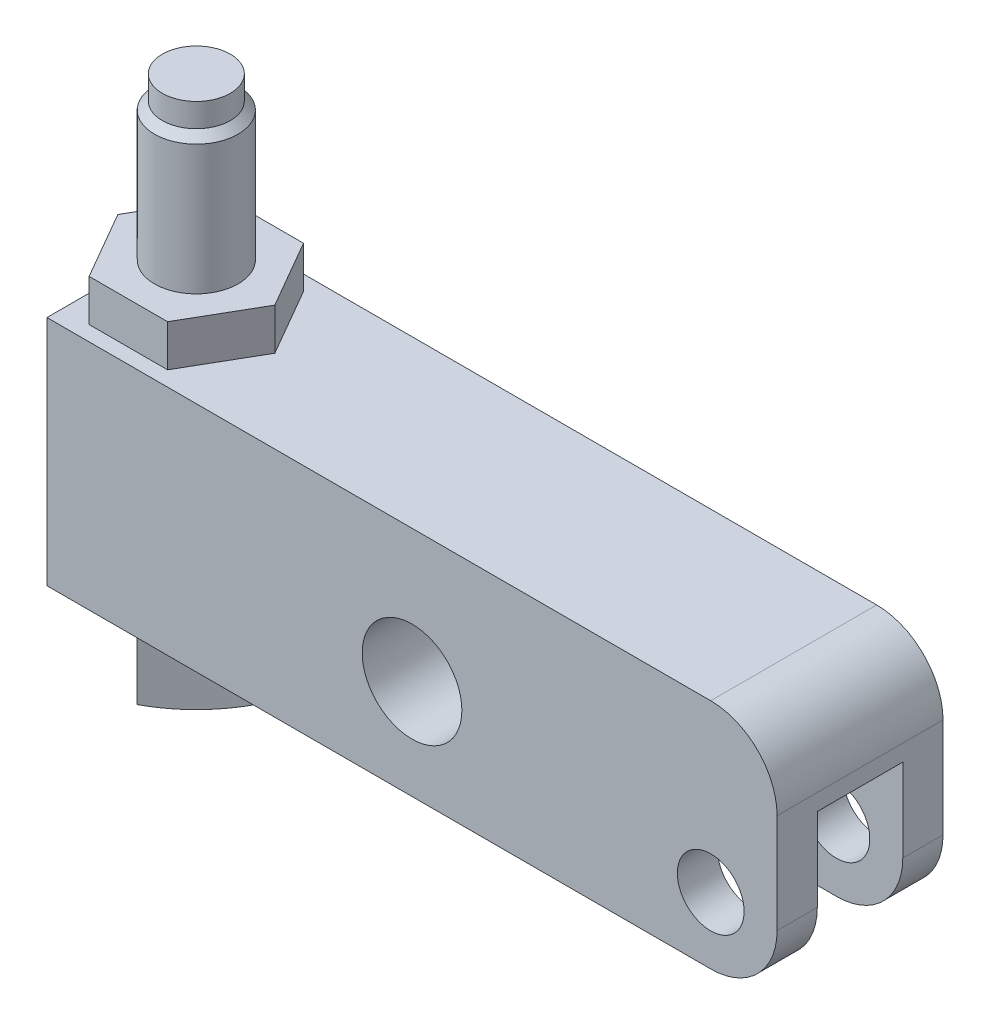
ISO-10303-21;
HEADER;
FILE_DESCRIPTION(('STEP AP214'),'2;1');
FILE_NAME('part.step','',(''),(''),'','','');
FILE_SCHEMA(('AUTOMOTIVE_DESIGN { 1 0 10303 214 1 1 1 1 }'));
ENDSEC;
DATA;
#1=APPLICATION_CONTEXT('core data for automotive mechanical design processes');
#2=APPLICATION_PROTOCOL_DEFINITION('international standard','automotive_design',2000,#1);
#3=PRODUCT_CONTEXT('',#1,'mechanical');
#4=PRODUCT('Part','Part','',(#3));
#5=PRODUCT_RELATED_PRODUCT_CATEGORY('part','',(#4));
#6=PRODUCT_DEFINITION_FORMATION('','',#4);
#7=PRODUCT_DEFINITION_CONTEXT('part definition',#1,'design');
#8=PRODUCT_DEFINITION('design','',#6,#7);
#9=PRODUCT_DEFINITION_SHAPE('','',#8);
#10=(LENGTH_UNIT() NAMED_UNIT(*) SI_UNIT(.MILLI.,.METRE.));
#11=(NAMED_UNIT(*) PLANE_ANGLE_UNIT() SI_UNIT($,.RADIAN.));
#12=(NAMED_UNIT(*) SI_UNIT($,.STERADIAN.) SOLID_ANGLE_UNIT());
#13=UNCERTAINTY_MEASURE_WITH_UNIT(LENGTH_MEASURE(1.E-05),#10,'distance_accuracy_value','');
#14=(GEOMETRIC_REPRESENTATION_CONTEXT(3) GLOBAL_UNCERTAINTY_ASSIGNED_CONTEXT((#13)) GLOBAL_UNIT_ASSIGNED_CONTEXT((#10,
#11,#12)) REPRESENTATION_CONTEXT('',''));
#15=CARTESIAN_POINT('',(0.,0.,0.));
#16=DIRECTION('',(0.,0.,1.));
#17=DIRECTION('',(1.,0.,0.));
#18=AXIS2_PLACEMENT_3D('',#15,#16,#17);
#19=CARTESIAN_POINT('',(-61.1505,-6.985,0.));
#20=DIRECTION('',(0.,1.,0.));
#21=DIRECTION('',(-1.,0.,0.));
#22=AXIS2_PLACEMENT_3D('',#19,#20,#21);
#23=PLANE('',#22);
#24=DIRECTION('',(0.707106781186547,0.,0.707106781186548));
#25=VECTOR('',#24,1.);
#26=CARTESIAN_POINT('',(-62.8075613562736,-6.98500000000001,0.));
#27=LINE('',#26,#25);
#28=CARTESIAN_POINT('',(-59.9787806781368,-6.98500000000001,2.82878067813678));
#29=VERTEX_POINT('',#28);
#30=CARTESIAN_POINT('',(-57.15,-6.98500000000001,5.65756135627357));
#31=VERTEX_POINT('',#30);
#32=EDGE_CURVE('E197',#29,#31,#27,.T.);
#33=ORIENTED_EDGE('',*,*,#32,.T.);
#34=DIRECTION('',(0.707106781186547,0.,-0.707106781186548));
#35=VECTOR('',#34,1.);
#36=CARTESIAN_POINT('',(-57.15,-6.98500000000001,5.65756135627357));
#37=LINE('',#36,#35);
#38=CARTESIAN_POINT('',(-54.3212193218632,-6.98500000000001,2.82878067813678));
#39=VERTEX_POINT('',#38);
#40=EDGE_CURVE('E206',#31,#39,#37,.T.);
#41=ORIENTED_EDGE('',*,*,#40,.T.);
#42=CARTESIAN_POINT('',(-57.15,-6.985,0.));
#43=DIRECTION('',(0.,1.,0.));
#44=DIRECTION('',(-1.,0.,0.));
#45=AXIS2_PLACEMENT_3D('',#42,#43,#44);
#46=CIRCLE('',#45,4.00050000000001);
#47=EDGE_CURVE('E215',#29,#39,#46,.T.);
#48=ORIENTED_EDGE('',*,*,#47,.F.);
#49=EDGE_LOOP('',(#33,#41,#48));
#50=FACE_BOUND('',#49,.T.);
#51=ADVANCED_FACE('F33',(#50),#23,.T.);
#52=CARTESIAN_POINT('',(-54.3212193218632,-6.98500000000001,-2.82878067813678));
#53=VERTEX_POINT('',#52);
#54=EDGE_CURVE('E235',#39,#53,#46,.T.);
#55=ORIENTED_EDGE('',*,*,#54,.F.);
#56=CARTESIAN_POINT('',(-51.4924386437264,-6.985,0.));
#57=VERTEX_POINT('',#56);
#58=EDGE_CURVE('E209',#39,#57,#37,.T.);
#59=ORIENTED_EDGE('',*,*,#58,.T.);
#60=DIRECTION('',(-0.707106781186547,0.,-0.707106781186548));
#61=VECTOR('',#60,1.);
#62=CARTESIAN_POINT('',(-51.4924386437264,-6.985,0.));
#63=LINE('',#62,#61);
#64=EDGE_CURVE('E412',#57,#53,#63,.T.);
#65=ORIENTED_EDGE('',*,*,#64,.T.);
#66=EDGE_LOOP('',(#55,#59,#65));
#67=FACE_BOUND('',#66,.T.);
#68=ADVANCED_FACE('F417',(#67),#23,.T.);
#69=CARTESIAN_POINT('',(-59.9787806781368,-6.98500000000001,-2.82878067813678));
#70=VERTEX_POINT('',#69);
#71=EDGE_CURVE('E421',#53,#70,#46,.T.);
#72=ORIENTED_EDGE('',*,*,#71,.F.);
#73=CARTESIAN_POINT('',(-57.15,-6.98500000000001,-5.65756135627357));
#74=VERTEX_POINT('',#73);
#75=EDGE_CURVE('E414',#53,#74,#63,.T.);
#76=ORIENTED_EDGE('',*,*,#75,.T.);
#77=DIRECTION('',(-0.707106781186547,0.,0.707106781186548));
#78=VECTOR('',#77,1.);
#79=CARTESIAN_POINT('',(-57.15,-6.98500000000001,-5.65756135627357));
#80=LINE('',#79,#78);
#81=EDGE_CURVE('E216',#74,#70,#80,.T.);
#82=ORIENTED_EDGE('',*,*,#81,.T.);
#83=EDGE_LOOP('',(#72,#76,#82));
#84=FACE_BOUND('',#83,.T.);
#85=ADVANCED_FACE('F431',(#84),#23,.T.);
#86=CARTESIAN_POINT('',(-62.8075613562736,-6.985,0.));
#87=VERTEX_POINT('',#86);
#88=EDGE_CURVE('E219',#70,#87,#80,.T.);
#89=ORIENTED_EDGE('',*,*,#88,.T.);
#90=EDGE_CURVE('E48',#87,#29,#27,.T.);
#91=ORIENTED_EDGE('',*,*,#90,.T.);
#92=EDGE_CURVE('E232',#70,#29,#46,.T.);
#93=ORIENTED_EDGE('',*,*,#92,.F.);
#94=EDGE_LOOP('',(#89,#91,#93));
#95=FACE_BOUND('',#94,.T.);
#96=ADVANCED_FACE('F428',(#95),#23,.T.);
#97=CARTESIAN_POINT('',(-63.5,15.875,7.9375));
#98=DIRECTION('',(0.,-1.,0.));
#99=DIRECTION('',(0.,0.,-1.));
#100=AXIS2_PLACEMENT_3D('',#97,#98,#99);
#101=PLANE('',#100);
#102=DIRECTION('',(-0.5,0.,0.866025403784439));
#103=VECTOR('',#102,1.);
#104=CARTESIAN_POINT('',(-60.9041623903786,15.875,-6.50239999999999));
#105=LINE('',#104,#103);
#106=CARTESIAN_POINT('',(-60.9041623903786,15.875,-6.50239999999999));
#107=VERTEX_POINT('',#106);
#108=CARTESIAN_POINT('',(-63.5,15.875,-2.00627737193762));
#109=VERTEX_POINT('',#108);
#110=EDGE_CURVE('E267',#107,#109,#105,.T.);
#111=ORIENTED_EDGE('',*,*,#110,.F.);
#112=DIRECTION('',(-1.,0.,0.));
#113=VECTOR('',#112,1.);
#114=CARTESIAN_POINT('',(-53.3958376096214,15.875,-6.50239999999999));
#115=LINE('',#114,#113);
#116=CARTESIAN_POINT('',(-53.3958376096214,15.875,-6.50239999999999));
#117=VERTEX_POINT('',#116);
#118=EDGE_CURVE('E263',#117,#107,#115,.T.);
#119=ORIENTED_EDGE('',*,*,#118,.F.);
#120=DIRECTION('',(-0.5,0.,-0.866025403784439));
#121=VECTOR('',#120,1.);
#122=CARTESIAN_POINT('',(-49.6416752192428,15.875,0.));
#123=LINE('',#122,#121);
#124=CARTESIAN_POINT('',(-49.6416752192428,15.875,0.));
#125=VERTEX_POINT('',#124);
#126=EDGE_CURVE('E260',#125,#117,#123,.T.);
#127=ORIENTED_EDGE('',*,*,#126,.F.);
#128=DIRECTION('',(0.5,0.,-0.866025403784439));
#129=VECTOR('',#128,1.);
#130=CARTESIAN_POINT('',(-53.3958376096214,15.875,6.5024));
#131=LINE('',#130,#129);
#132=CARTESIAN_POINT('',(-53.3958376096214,15.875,6.5024));
#133=VERTEX_POINT('',#132);
#134=EDGE_CURVE('E242',#133,#125,#131,.T.);
#135=ORIENTED_EDGE('',*,*,#134,.F.);
#136=DIRECTION('',(1.,0.,0.));
#137=VECTOR('',#136,1.);
#138=CARTESIAN_POINT('',(-60.9041623903786,15.875,6.5024));
#139=LINE('',#138,#137);
#140=CARTESIAN_POINT('',(-60.9041623903786,15.875,6.5024));
#141=VERTEX_POINT('',#140);
#142=EDGE_CURVE('E247',#141,#133,#139,.T.);
#143=ORIENTED_EDGE('',*,*,#142,.F.);
#144=DIRECTION('',(0.5,0.,0.866025403784439));
#145=VECTOR('',#144,1.);
#146=CARTESIAN_POINT('',(-60.9317052642984,15.875,6.45469434298441));
#147=LINE('',#146,#145);
#148=CARTESIAN_POINT('',(-63.5,15.875,2.00627737193762));
#149=VERTEX_POINT('',#148);
#150=EDGE_CURVE('E397',#149,#141,#147,.T.);
#151=ORIENTED_EDGE('',*,*,#150,.F.);
#152=DIRECTION('',(0.,0.,-1.));
#153=VECTOR('',#152,1.);
#154=CARTESIAN_POINT('',(-63.5,15.875,7.9375));
#155=LINE('',#154,#153);
#156=CARTESIAN_POINT('',(-63.5,15.875,7.9375));
#157=VERTEX_POINT('',#156);
#158=EDGE_CURVE('E359',#157,#149,#155,.T.);
#159=ORIENTED_EDGE('',*,*,#158,.F.);
#160=DIRECTION('',(-1.,0.,0.));
#161=VECTOR('',#160,1.);
#162=CARTESIAN_POINT('',(-63.5,15.875,7.9375));
#163=LINE('',#162,#161);
#164=CARTESIAN_POINT('',(0.,15.875,7.9375));
#165=VERTEX_POINT('',#164);
#166=EDGE_CURVE('E346',#165,#157,#163,.T.);
#167=ORIENTED_EDGE('',*,*,#166,.F.);
#168=DIRECTION('',(0.,0.,-1.));
#169=VECTOR('',#168,1.);
#170=CARTESIAN_POINT('',(0.,15.875,7.9375));
#171=LINE('',#170,#169);
#172=CARTESIAN_POINT('',(0.,15.875,-7.9375));
#173=VERTEX_POINT('',#172);
#174=EDGE_CURVE('E366',#165,#173,#171,.T.);
#175=ORIENTED_EDGE('',*,*,#174,.T.);
#176=DIRECTION('',(-1.,0.,0.));
#177=VECTOR('',#176,1.);
#178=CARTESIAN_POINT('',(-63.5,15.875,-7.9375));
#179=LINE('',#178,#177);
#180=CARTESIAN_POINT('',(-63.5,15.875,-7.9375));
#181=VERTEX_POINT('',#180);
#182=EDGE_CURVE('E340',#173,#181,#179,.T.);
#183=ORIENTED_EDGE('',*,*,#182,.T.);
#184=EDGE_CURVE('E348',#109,#181,#155,.T.);
#185=ORIENTED_EDGE('',*,*,#184,.F.);
#186=EDGE_LOOP('',(#111,#119,#127,#135,#143,#151,#159,#167,#175,#183,#185));
#187=FACE_BOUND('',#186,.T.);
#188=ADVANCED_FACE('F438',(#187),#101,.F.);
#189=CARTESIAN_POINT('',(0.,0.,7.9375));
#190=DIRECTION('',(0.,0.,-1.));
#191=DIRECTION('',(-1.,0.,0.));
#192=AXIS2_PLACEMENT_3D('',#189,#190,#191);
#193=CYLINDRICAL_SURFACE('',#192,3.19405);
#194=CARTESIAN_POINT('',(0.,0.,4.0894));
#195=DIRECTION('',(0.,0.,1.));
#196=DIRECTION('',(1.,0.,0.));
#197=AXIS2_PLACEMENT_3D('',#194,#195,#196);
#198=CIRCLE('',#197,3.19405);
#199=CARTESIAN_POINT('',(3.19405,0.,4.0894));
#200=VERTEX_POINT('',#199);
#201=EDGE_CURVE('E329',#200,#200,#198,.T.);
#202=ORIENTED_EDGE('',*,*,#201,.F.);
#203=EDGE_LOOP('',(#202));
#204=FACE_BOUND('',#203,.T.);
#205=CARTESIAN_POINT('',(0.,0.,7.9375));
#206=DIRECTION('',(0.,0.,1.));
#207=DIRECTION('',(1.,0.,0.));
#208=AXIS2_PLACEMENT_3D('',#205,#206,#207);
#209=CIRCLE('',#208,3.19405);
#210=CARTESIAN_POINT('',(3.19405,0.,7.9375));
#211=VERTEX_POINT('',#210);
#212=EDGE_CURVE('E330',#211,#211,#209,.T.);
#213=ORIENTED_EDGE('',*,*,#212,.T.);
#214=EDGE_LOOP('',(#213));
#215=FACE_BOUND('',#214,.T.);
#216=ADVANCED_FACE('F593',(#204,#215),#193,.F.);
#217=CARTESIAN_POINT('',(-63.5,-6.35,7.9375));
#218=DIRECTION('',(0.,0.,1.));
#219=DIRECTION('',(1.,0.,0.));
#220=AXIS2_PLACEMENT_3D('',#217,#218,#219);
#221=PLANE('',#220);
#222=ORIENTED_EDGE('',*,*,#212,.F.);
#223=EDGE_LOOP('',(#222));
#224=FACE_BOUND('',#223,.T.);
#225=DIRECTION('',(0.,1.,0.));
#226=VECTOR('',#225,1.);
#227=CARTESIAN_POINT('',(6.35,15.875,7.9375));
#228=LINE('',#227,#226);
#229=CARTESIAN_POINT('',(6.35,0.,7.9375));
#230=VERTEX_POINT('',#229);
#231=CARTESIAN_POINT('',(6.35,9.525,7.9375));
#232=VERTEX_POINT('',#231);
#233=EDGE_CURVE('E343',#230,#232,#228,.T.);
#234=ORIENTED_EDGE('',*,*,#233,.T.);
#235=CARTESIAN_POINT('',(0.,9.525,7.9375));
#236=DIRECTION('',(0.,0.,1.));
#237=DIRECTION('',(1.,0.,0.));
#238=AXIS2_PLACEMENT_3D('',#235,#236,#237);
#239=CIRCLE('',#238,6.35);
#240=EDGE_CURVE('E387',#232,#165,#239,.T.);
#241=ORIENTED_EDGE('',*,*,#240,.T.);
#242=ORIENTED_EDGE('',*,*,#166,.T.);
#243=DIRECTION('',(0.,-1.,0.));
#244=VECTOR('',#243,1.);
#245=CARTESIAN_POINT('',(-63.5,15.875,7.9375));
#246=LINE('',#245,#244);
#247=CARTESIAN_POINT('',(-63.5,-6.35,7.9375));
#248=VERTEX_POINT('',#247);
#249=EDGE_CURVE('E336',#157,#248,#246,.T.);
#250=ORIENTED_EDGE('',*,*,#249,.T.);
#251=DIRECTION('',(1.,0.,0.));
#252=VECTOR('',#251,1.);
#253=CARTESIAN_POINT('',(-63.5,-6.35,7.9375));
#254=LINE('',#253,#252);
#255=CARTESIAN_POINT('',(0.,-6.35,7.9375));
#256=VERTEX_POINT('',#255);
#257=EDGE_CURVE('E339',#248,#256,#254,.T.);
#258=ORIENTED_EDGE('',*,*,#257,.T.);
#259=CARTESIAN_POINT('',(0.,0.,7.9375));
#260=DIRECTION('',(0.,0.,1.));
#261=DIRECTION('',(1.,0.,0.));
#262=AXIS2_PLACEMENT_3D('',#259,#260,#261);
#263=CIRCLE('',#262,6.35);
#264=EDGE_CURVE('E385',#256,#230,#263,.T.);
#265=ORIENTED_EDGE('',*,*,#264,.T.);
#266=EDGE_LOOP('',(#234,#241,#242,#250,#258,#265));
#267=FACE_BOUND('',#266,.T.);
#268=CARTESIAN_POINT('',(-28.575,3.175,7.9375));
#269=DIRECTION('',(0.,0.,1.));
#270=DIRECTION('',(1.,0.,0.));
#271=AXIS2_PLACEMENT_3D('',#268,#269,#270);
#272=CIRCLE('',#271,4.76885);
#273=CARTESIAN_POINT('',(-23.80615,3.175,7.9375));
#274=VERTEX_POINT('',#273);
#275=EDGE_CURVE('E322',#274,#274,#272,.T.);
#276=ORIENTED_EDGE('',*,*,#275,.F.);
#277=EDGE_LOOP('',(#276));
#278=FACE_BOUND('',#277,.T.);
#279=ADVANCED_FACE('F594',(#224,#267,#278),#221,.T.);
#280=CARTESIAN_POINT('',(-63.5,-6.35,-7.9375));
#281=DIRECTION('',(0.,0.,1.));
#282=DIRECTION('',(1.,0.,0.));
#283=AXIS2_PLACEMENT_3D('',#280,#281,#282);
#284=PLANE('',#283);
#285=CARTESIAN_POINT('',(0.,0.,-7.9375));
#286=DIRECTION('',(0.,0.,1.));
#287=DIRECTION('',(1.,0.,0.));
#288=AXIS2_PLACEMENT_3D('',#285,#286,#287);
#289=CIRCLE('',#288,3.19405);
#290=CARTESIAN_POINT('',(3.19405,0.,-7.9375));
#291=VERTEX_POINT('',#290);
#292=EDGE_CURVE('E325',#291,#291,#289,.T.);
#293=ORIENTED_EDGE('',*,*,#292,.T.);
#294=EDGE_LOOP('',(#293));
#295=FACE_BOUND('',#294,.T.);
#296=ORIENTED_EDGE('',*,*,#182,.F.);
#297=CARTESIAN_POINT('',(0.,9.525,-7.9375));
#298=DIRECTION('',(0.,0.,1.));
#299=DIRECTION('',(1.,0.,0.));
#300=AXIS2_PLACEMENT_3D('',#297,#298,#299);
#301=CIRCLE('',#300,6.35);
#302=CARTESIAN_POINT('',(6.35,9.525,-7.9375));
#303=VERTEX_POINT('',#302);
#304=EDGE_CURVE('E375',#173,#303,#301,.F.);
#305=ORIENTED_EDGE('',*,*,#304,.T.);
#306=DIRECTION('',(0.,1.,0.));
#307=VECTOR('',#306,1.);
#308=CARTESIAN_POINT('',(6.35,15.875,-7.9375));
#309=LINE('',#308,#307);
#310=CARTESIAN_POINT('',(6.35,0.,-7.9375));
#311=VERTEX_POINT('',#310);
#312=EDGE_CURVE('E354',#311,#303,#309,.T.);
#313=ORIENTED_EDGE('',*,*,#312,.F.);
#314=CARTESIAN_POINT('',(0.,0.,-7.9375));
#315=DIRECTION('',(0.,0.,1.));
#316=DIRECTION('',(1.,0.,0.));
#317=AXIS2_PLACEMENT_3D('',#314,#315,#316);
#318=CIRCLE('',#317,6.35);
#319=CARTESIAN_POINT('',(0.,-6.35,-7.9375));
#320=VERTEX_POINT('',#319);
#321=EDGE_CURVE('E373',#311,#320,#318,.F.);
#322=ORIENTED_EDGE('',*,*,#321,.T.);
#323=DIRECTION('',(1.,0.,0.));
#324=VECTOR('',#323,1.);
#325=CARTESIAN_POINT('',(-63.5,-6.35,-7.9375));
#326=LINE('',#325,#324);
#327=CARTESIAN_POINT('',(-63.5,-6.35,-7.9375));
#328=VERTEX_POINT('',#327);
#329=EDGE_CURVE('E351',#328,#320,#326,.T.);
#330=ORIENTED_EDGE('',*,*,#329,.F.);
#331=DIRECTION('',(0.,-1.,0.));
#332=VECTOR('',#331,1.);
#333=CARTESIAN_POINT('',(-63.5,15.875,-7.9375));
#334=LINE('',#333,#332);
#335=EDGE_CURVE('E333',#181,#328,#334,.T.);
#336=ORIENTED_EDGE('',*,*,#335,.F.);
#337=EDGE_LOOP('',(#296,#305,#313,#322,#330,#336));
#338=FACE_BOUND('',#337,.T.);
#339=CARTESIAN_POINT('',(-28.575,3.175,-7.9375));
#340=DIRECTION('',(0.,0.,1.));
#341=DIRECTION('',(1.,0.,0.));
#342=AXIS2_PLACEMENT_3D('',#339,#340,#341);
#343=CIRCLE('',#342,4.76885);
#344=CARTESIAN_POINT('',(-23.80615,3.175,-7.9375));
#345=VERTEX_POINT('',#344);
#346=EDGE_CURVE('E326',#345,#345,#343,.T.);
#347=ORIENTED_EDGE('',*,*,#346,.T.);
#348=EDGE_LOOP('',(#347));
#349=FACE_BOUND('',#348,.T.);
#350=ADVANCED_FACE('F597',(#295,#338,#349),#284,.F.);
#351=CARTESIAN_POINT('',(-63.5,15.875,7.9375));
#352=DIRECTION('',(1.,0.,0.));
#353=DIRECTION('',(0.,0.,-1.));
#354=AXIS2_PLACEMENT_3D('',#351,#352,#353);
#355=PLANE('',#354);
#356=ORIENTED_EDGE('',*,*,#335,.T.);
#357=DIRECTION('',(0.,0.,-1.));
#358=VECTOR('',#357,1.);
#359=CARTESIAN_POINT('',(-63.5,-6.35,7.9375));
#360=LINE('',#359,#358);
#361=EDGE_CURVE('E362',#248,#328,#360,.T.);
#362=ORIENTED_EDGE('',*,*,#361,.F.);
#363=ORIENTED_EDGE('',*,*,#249,.F.);
#364=ORIENTED_EDGE('',*,*,#158,.T.);
#365=EDGE_CURVE('E363',#149,#109,#155,.T.);
#366=ORIENTED_EDGE('',*,*,#365,.T.);
#367=ORIENTED_EDGE('',*,*,#184,.T.);
#368=EDGE_LOOP('',(#356,#362,#363,#364,#366,#367));
#369=FACE_BOUND('',#368,.T.);
#370=ADVANCED_FACE('F601',(#369),#355,.F.);
#371=CARTESIAN_POINT('',(-63.5,-6.35,7.9375));
#372=DIRECTION('',(0.,1.,0.));
#373=DIRECTION('',(0.,0.,1.));
#374=AXIS2_PLACEMENT_3D('',#371,#372,#373);
#375=PLANE('',#374);
#376=CARTESIAN_POINT('',(-57.15,-6.35,0.));
#377=DIRECTION('',(0.,1.,0.));
#378=DIRECTION('',(0.,0.,1.));
#379=AXIS2_PLACEMENT_3D('',#376,#377,#378);
#380=CIRCLE('',#379,4.00050000000001);
#381=CARTESIAN_POINT('',(-57.15,-6.35,4.00050000000001));
#382=VERTEX_POINT('',#381);
#383=EDGE_CURVE('E239',#382,#382,#380,.T.);
#384=ORIENTED_EDGE('',*,*,#383,.T.);
#385=EDGE_LOOP('',(#384));
#386=FACE_BOUND('',#385,.T.);
#387=ORIENTED_EDGE('',*,*,#329,.T.);
#388=DIRECTION('',(0.,0.,-1.));
#389=VECTOR('',#388,1.);
#390=CARTESIAN_POINT('',(0.,-6.35,7.9375));
#391=LINE('',#390,#389);
#392=CARTESIAN_POINT('',(0.,-6.35,-4.0894));
#393=VERTEX_POINT('',#392);
#394=EDGE_CURVE('E391',#320,#393,#391,.F.);
#395=ORIENTED_EDGE('',*,*,#394,.T.);
#396=DIRECTION('',(1.,0.,0.));
#397=VECTOR('',#396,1.);
#398=CARTESIAN_POINT('',(-7.9248,-6.35,-4.0894));
#399=LINE('',#398,#397);
#400=CARTESIAN_POINT('',(-7.9248,-6.35,-4.0894));
#401=VERTEX_POINT('',#400);
#402=EDGE_CURVE('E307',#401,#393,#399,.T.);
#403=ORIENTED_EDGE('',*,*,#402,.F.);
#404=CARTESIAN_POINT('',(-7.9248,-6.35,0.));
#405=DIRECTION('',(0.,-1.,0.));
#406=DIRECTION('',(0.,0.,-1.));
#407=AXIS2_PLACEMENT_3D('',#404,#405,#406);
#408=CIRCLE('',#407,4.0894);
#409=CARTESIAN_POINT('',(-7.9248,-6.35,4.0894));
#410=VERTEX_POINT('',#409);
#411=EDGE_CURVE('E292',#410,#401,#408,.T.);
#412=ORIENTED_EDGE('',*,*,#411,.F.);
#413=DIRECTION('',(-1.,0.,0.));
#414=VECTOR('',#413,1.);
#415=CARTESIAN_POINT('',(-7.9248,-6.35,4.0894));
#416=LINE('',#415,#414);
#417=CARTESIAN_POINT('',(0.,-6.35,4.0894));
#418=VERTEX_POINT('',#417);
#419=EDGE_CURVE('E297',#418,#410,#416,.T.);
#420=ORIENTED_EDGE('',*,*,#419,.F.);
#421=DIRECTION('',(0.,0.,-1.));
#422=VECTOR('',#421,1.);
#423=CARTESIAN_POINT('',(0.,-6.35,7.9375));
#424=LINE('',#423,#422);
#425=EDGE_CURVE('E389',#418,#256,#424,.F.);
#426=ORIENTED_EDGE('',*,*,#425,.T.);
#427=ORIENTED_EDGE('',*,*,#257,.F.);
#428=ORIENTED_EDGE('',*,*,#361,.T.);
#429=EDGE_LOOP('',(#387,#395,#403,#412,#420,#426,#427,#428));
#430=FACE_BOUND('',#429,.T.);
#431=ADVANCED_FACE('F607',(#386,#430),#375,.F.);
#432=CARTESIAN_POINT('',(6.35,15.875,7.9375));
#433=DIRECTION('',(-1.,0.,0.));
#434=DIRECTION('',(0.,-1.,0.));
#435=AXIS2_PLACEMENT_3D('',#432,#433,#434);
#436=PLANE('',#435);
#437=ORIENTED_EDGE('',*,*,#312,.T.);
#438=DIRECTION('',(0.,0.,-1.));
#439=VECTOR('',#438,1.);
#440=CARTESIAN_POINT('',(6.35,9.525,7.9375));
#441=LINE('',#440,#439);
#442=EDGE_CURVE('E383',#303,#232,#441,.F.);
#443=ORIENTED_EDGE('',*,*,#442,.T.);
#444=ORIENTED_EDGE('',*,*,#233,.F.);
#445=DIRECTION('',(0.,0.,-1.));
#446=VECTOR('',#445,1.);
#447=CARTESIAN_POINT('',(6.35,0.,7.9375));
#448=LINE('',#447,#446);
#449=CARTESIAN_POINT('',(6.34999999999999,0.,4.0894));
#450=VERTEX_POINT('',#449);
#451=EDGE_CURVE('E377',#230,#450,#448,.T.);
#452=ORIENTED_EDGE('',*,*,#451,.T.);
#453=DIRECTION('',(0.,-1.,0.));
#454=VECTOR('',#453,1.);
#455=CARTESIAN_POINT('',(6.34999999999999,7.9502,4.0894));
#456=LINE('',#455,#454);
#457=CARTESIAN_POINT('',(6.34999999999999,7.9502,4.0894));
#458=VERTEX_POINT('',#457);
#459=EDGE_CURVE('E315',#458,#450,#456,.T.);
#460=ORIENTED_EDGE('',*,*,#459,.F.);
#461=DIRECTION('',(0.,0.,1.));
#462=VECTOR('',#461,1.);
#463=CARTESIAN_POINT('',(6.34999999999999,7.9502,4.0894));
#464=LINE('',#463,#462);
#465=CARTESIAN_POINT('',(6.35,7.9502,-4.0894));
#466=VERTEX_POINT('',#465);
#467=EDGE_CURVE('E299',#466,#458,#464,.T.);
#468=ORIENTED_EDGE('',*,*,#467,.F.);
#469=DIRECTION('',(0.,-1.,0.));
#470=VECTOR('',#469,1.);
#471=CARTESIAN_POINT('',(6.35,7.9502,-4.0894));
#472=LINE('',#471,#470);
#473=CARTESIAN_POINT('',(6.35,0.,-4.0894));
#474=VERTEX_POINT('',#473);
#475=EDGE_CURVE('E318',#466,#474,#472,.T.);
#476=ORIENTED_EDGE('',*,*,#475,.T.);
#477=DIRECTION('',(0.,0.,-1.));
#478=VECTOR('',#477,1.);
#479=CARTESIAN_POINT('',(6.35,0.,7.9375));
#480=LINE('',#479,#478);
#481=EDGE_CURVE('E380',#474,#311,#480,.T.);
#482=ORIENTED_EDGE('',*,*,#481,.T.);
#483=EDGE_LOOP('',(#437,#443,#444,#452,#460,#468,#476,#482));
#484=FACE_BOUND('',#483,.T.);
#485=ADVANCED_FACE('F591',(#484),#436,.F.);
#486=CARTESIAN_POINT('',(0.,0.,-4.0894));
#487=DIRECTION('',(0.,0.,-1.));
#488=DIRECTION('',(-1.,0.,0.));
#489=AXIS2_PLACEMENT_3D('',#486,#487,#488);
#490=CIRCLE('',#489,3.19405);
#491=CARTESIAN_POINT('',(-3.19405,0.,-4.0894));
#492=VERTEX_POINT('',#491);
#493=EDGE_CURVE('E314',#492,#492,#490,.T.);
#494=ORIENTED_EDGE('',*,*,#493,.F.);
#495=EDGE_LOOP('',(#494));
#496=FACE_BOUND('',#495,.T.);
#497=ORIENTED_EDGE('',*,*,#292,.F.);
#498=EDGE_LOOP('',(#497));
#499=FACE_BOUND('',#498,.T.);
#500=ADVANCED_FACE('F587',(#496,#499),#193,.F.);
#501=CARTESIAN_POINT('',(-28.575,3.175,7.9375));
#502=DIRECTION('',(0.,0.,-1.));
#503=DIRECTION('',(-1.,0.,0.));
#504=AXIS2_PLACEMENT_3D('',#501,#502,#503);
#505=CYLINDRICAL_SURFACE('',#504,4.76885);
#506=ORIENTED_EDGE('',*,*,#275,.T.);
#507=EDGE_LOOP('',(#506));
#508=FACE_BOUND('',#507,.T.);
#509=ORIENTED_EDGE('',*,*,#346,.F.);
#510=EDGE_LOOP('',(#509));
#511=FACE_BOUND('',#510,.T.);
#512=ADVANCED_FACE('F583',(#508,#511),#505,.F.);
#513=CARTESIAN_POINT('',(-7.9248,7.9502,0.));
#514=DIRECTION('',(0.,-1.,0.));
#515=DIRECTION('',(0.,0.,-1.));
#516=AXIS2_PLACEMENT_3D('',#513,#514,#515);
#517=CYLINDRICAL_SURFACE('',#516,4.0894);
#518=ORIENTED_EDGE('',*,*,#411,.T.);
#519=DIRECTION('',(0.,-1.,0.));
#520=VECTOR('',#519,1.);
#521=CARTESIAN_POINT('',(-7.9248,7.9502,-4.0894));
#522=LINE('',#521,#520);
#523=CARTESIAN_POINT('',(-7.9248,7.9502,-4.0894));
#524=VERTEX_POINT('',#523);
#525=EDGE_CURVE('E304',#524,#401,#522,.T.);
#526=ORIENTED_EDGE('',*,*,#525,.F.);
#527=CARTESIAN_POINT('',(-7.9248,7.9502,0.));
#528=DIRECTION('',(0.,-1.,0.));
#529=DIRECTION('',(0.,0.,-1.));
#530=AXIS2_PLACEMENT_3D('',#527,#528,#529);
#531=CIRCLE('',#530,4.0894);
#532=CARTESIAN_POINT('',(-7.9248,7.9502,4.0894));
#533=VERTEX_POINT('',#532);
#534=EDGE_CURVE('E293',#533,#524,#531,.T.);
#535=ORIENTED_EDGE('',*,*,#534,.F.);
#536=DIRECTION('',(0.,-1.,0.));
#537=VECTOR('',#536,1.);
#538=CARTESIAN_POINT('',(-7.9248,7.9502,4.0894));
#539=LINE('',#538,#537);
#540=EDGE_CURVE('E311',#533,#410,#539,.T.);
#541=ORIENTED_EDGE('',*,*,#540,.T.);
#542=EDGE_LOOP('',(#518,#526,#535,#541));
#543=FACE_BOUND('',#542,.T.);
#544=ADVANCED_FACE('F576',(#543),#517,.F.);
#545=CARTESIAN_POINT('',(-7.9248,7.9502,4.0894));
#546=DIRECTION('',(0.,0.,1.));
#547=DIRECTION('',(1.,0.,0.));
#548=AXIS2_PLACEMENT_3D('',#545,#546,#547);
#549=PLANE('',#548);
#550=ORIENTED_EDGE('',*,*,#201,.T.);
#551=EDGE_LOOP('',(#550));
#552=FACE_BOUND('',#551,.T.);
#553=ORIENTED_EDGE('',*,*,#459,.T.);
#554=CARTESIAN_POINT('',(0.,0.,4.0894));
#555=DIRECTION('',(0.,0.,1.));
#556=DIRECTION('',(1.,0.,0.));
#557=AXIS2_PLACEMENT_3D('',#554,#555,#556);
#558=CIRCLE('',#557,6.35);
#559=EDGE_CURVE('E395',#450,#418,#558,.F.);
#560=ORIENTED_EDGE('',*,*,#559,.T.);
#561=ORIENTED_EDGE('',*,*,#419,.T.);
#562=ORIENTED_EDGE('',*,*,#540,.F.);
#563=DIRECTION('',(-1.,0.,0.));
#564=VECTOR('',#563,1.);
#565=CARTESIAN_POINT('',(-7.9248,7.9502,4.0894));
#566=LINE('',#565,#564);
#567=EDGE_CURVE('E301',#458,#533,#566,.T.);
#568=ORIENTED_EDGE('',*,*,#567,.F.);
#569=EDGE_LOOP('',(#553,#560,#561,#562,#568));
#570=FACE_BOUND('',#569,.T.);
#571=ADVANCED_FACE('F573',(#552,#570),#549,.F.);
#572=CARTESIAN_POINT('',(-7.9248,7.9502,-4.0894));
#573=DIRECTION('',(0.,0.,-1.));
#574=DIRECTION('',(-1.,0.,0.));
#575=AXIS2_PLACEMENT_3D('',#572,#573,#574);
#576=PLANE('',#575);
#577=ORIENTED_EDGE('',*,*,#493,.T.);
#578=EDGE_LOOP('',(#577));
#579=FACE_BOUND('',#578,.T.);
#580=ORIENTED_EDGE('',*,*,#402,.T.);
#581=CARTESIAN_POINT('',(0.,0.,-4.0894));
#582=DIRECTION('',(0.,0.,-1.));
#583=DIRECTION('',(-1.,0.,0.));
#584=AXIS2_PLACEMENT_3D('',#581,#582,#583);
#585=CIRCLE('',#584,6.35);
#586=EDGE_CURVE('E393',#393,#474,#585,.F.);
#587=ORIENTED_EDGE('',*,*,#586,.T.);
#588=ORIENTED_EDGE('',*,*,#475,.F.);
#589=DIRECTION('',(1.,0.,0.));
#590=VECTOR('',#589,1.);
#591=CARTESIAN_POINT('',(-7.9248,7.9502,-4.0894));
#592=LINE('',#591,#590);
#593=EDGE_CURVE('E296',#524,#466,#592,.T.);
#594=ORIENTED_EDGE('',*,*,#593,.F.);
#595=ORIENTED_EDGE('',*,*,#525,.T.);
#596=EDGE_LOOP('',(#580,#587,#588,#594,#595));
#597=FACE_BOUND('',#596,.T.);
#598=ADVANCED_FACE('F571',(#579,#597),#576,.F.);
#599=CARTESIAN_POINT('',(-7.9248,7.9502,0.));
#600=DIRECTION('',(0.,-1.,0.));
#601=DIRECTION('',(0.,0.,-1.));
#602=AXIS2_PLACEMENT_3D('',#599,#600,#601);
#603=PLANE('',#602);
#604=ORIENTED_EDGE('',*,*,#534,.T.);
#605=ORIENTED_EDGE('',*,*,#593,.T.);
#606=ORIENTED_EDGE('',*,*,#467,.T.);
#607=ORIENTED_EDGE('',*,*,#567,.T.);
#608=EDGE_LOOP('',(#604,#605,#606,#607));
#609=FACE_BOUND('',#608,.T.);
#610=ADVANCED_FACE('F567',(#609),#603,.T.);
#611=CARTESIAN_POINT('',(0.,9.525,7.9375));
#612=DIRECTION('',(0.,0.,-1.));
#613=DIRECTION('',(-1.,0.,0.));
#614=AXIS2_PLACEMENT_3D('',#611,#612,#613);
#615=CYLINDRICAL_SURFACE('',#614,6.35);
#616=ORIENTED_EDGE('',*,*,#240,.F.);
#617=ORIENTED_EDGE('',*,*,#442,.F.);
#618=ORIENTED_EDGE('',*,*,#304,.F.);
#619=ORIENTED_EDGE('',*,*,#174,.F.);
#620=EDGE_LOOP('',(#616,#617,#618,#619));
#621=FACE_BOUND('',#620,.T.);
#622=ADVANCED_FACE('F570',(#621),#615,.T.);
#623=CARTESIAN_POINT('',(0.,0.,7.9375));
#624=DIRECTION('',(0.,0.,-1.));
#625=DIRECTION('',(-1.,0.,0.));
#626=AXIS2_PLACEMENT_3D('',#623,#624,#625);
#627=CYLINDRICAL_SURFACE('',#626,6.35);
#628=ORIENTED_EDGE('',*,*,#586,.F.);
#629=ORIENTED_EDGE('',*,*,#394,.F.);
#630=ORIENTED_EDGE('',*,*,#321,.F.);
#631=ORIENTED_EDGE('',*,*,#481,.F.);
#632=EDGE_LOOP('',(#628,#629,#630,#631));
#633=FACE_BOUND('',#632,.T.);
#634=ADVANCED_FACE('F616',(#633),#627,.T.);
#635=CARTESIAN_POINT('',(0.,0.,7.9375));
#636=DIRECTION('',(0.,0.,-1.));
#637=DIRECTION('',(-1.,0.,0.));
#638=AXIS2_PLACEMENT_3D('',#635,#636,#637);
#639=CYLINDRICAL_SURFACE('',#638,6.35);
#640=ORIENTED_EDGE('',*,*,#264,.F.);
#641=ORIENTED_EDGE('',*,*,#425,.F.);
#642=ORIENTED_EDGE('',*,*,#559,.F.);
#643=ORIENTED_EDGE('',*,*,#451,.F.);
#644=EDGE_LOOP('',(#640,#641,#642,#643));
#645=FACE_BOUND('',#644,.T.);
#646=ADVANCED_FACE('F35',(#645),#639,.T.);
#647=CARTESIAN_POINT('',(-53.3958376096214,15.875,6.5024));
#648=DIRECTION('',(0.,-1.,0.));
#649=DIRECTION('',(0.,0.,-1.));
#650=AXIS2_PLACEMENT_3D('',#647,#648,#649);
#651=PLANE('',#650);
#652=ORIENTED_EDGE('',*,*,#365,.F.);
#653=DIRECTION('',(0.5,0.,0.866025403784439));
#654=VECTOR('',#653,1.);
#655=CARTESIAN_POINT('',(-64.6583247807572,15.875,0.));
#656=LINE('',#655,#654);
#657=CARTESIAN_POINT('',(-64.6583247807572,15.875,0.));
#658=VERTEX_POINT('',#657);
#659=EDGE_CURVE('E270',#658,#149,#656,.T.);
#660=ORIENTED_EDGE('',*,*,#659,.F.);
#661=EDGE_CURVE('E266',#109,#658,#105,.T.);
#662=ORIENTED_EDGE('',*,*,#661,.F.);
#663=EDGE_LOOP('',(#652,#660,#662));
#664=FACE_BOUND('',#663,.T.);
#665=ADVANCED_FACE('F540',(#664),#651,.T.);
#666=CARTESIAN_POINT('',(-53.3958376096214,19.8628,6.5024));
#667=DIRECTION('',(-0.866025403784439,0.,-0.5));
#668=DIRECTION('',(-0.5,0.,0.866025403784439));
#669=AXIS2_PLACEMENT_3D('',#666,#667,#668);
#670=PLANE('',#669);
#671=ORIENTED_EDGE('',*,*,#134,.T.);
#672=DIRECTION('',(0.,-1.,0.));
#673=VECTOR('',#672,1.);
#674=CARTESIAN_POINT('',(-49.6416752192428,19.8628,0.));
#675=LINE('',#674,#673);
#676=CARTESIAN_POINT('',(-49.6416752192428,19.8628,0.));
#677=VERTEX_POINT('',#676);
#678=EDGE_CURVE('E289',#677,#125,#675,.T.);
#679=ORIENTED_EDGE('',*,*,#678,.F.);
#680=DIRECTION('',(0.5,0.,-0.866025403784439));
#681=VECTOR('',#680,1.);
#682=CARTESIAN_POINT('',(-53.3958376096214,19.8628,6.5024));
#683=LINE('',#682,#681);
#684=CARTESIAN_POINT('',(-53.3958376096214,19.8628,6.5024));
#685=VERTEX_POINT('',#684);
#686=EDGE_CURVE('E243',#685,#677,#683,.T.);
#687=ORIENTED_EDGE('',*,*,#686,.F.);
#688=DIRECTION('',(0.,-1.,0.));
#689=VECTOR('',#688,1.);
#690=CARTESIAN_POINT('',(-53.3958376096214,19.8628,6.5024));
#691=LINE('',#690,#689);
#692=EDGE_CURVE('E257',#685,#133,#691,.T.);
#693=ORIENTED_EDGE('',*,*,#692,.T.);
#694=EDGE_LOOP('',(#671,#679,#687,#693));
#695=FACE_BOUND('',#694,.T.);
#696=ADVANCED_FACE('F543',(#695),#670,.F.);
#697=CARTESIAN_POINT('',(-49.6416752192428,19.8628,0.));
#698=DIRECTION('',(-0.866025403784438,0.,0.5));
#699=DIRECTION('',(0.5,0.,0.866025403784439));
#700=AXIS2_PLACEMENT_3D('',#697,#698,#699);
#701=PLANE('',#700);
#702=ORIENTED_EDGE('',*,*,#126,.T.);
#703=DIRECTION('',(0.,-1.,0.));
#704=VECTOR('',#703,1.);
#705=CARTESIAN_POINT('',(-53.3958376096214,19.8628,-6.50239999999999));
#706=LINE('',#705,#704);
#707=CARTESIAN_POINT('',(-53.3958376096214,19.8628,-6.50239999999999));
#708=VERTEX_POINT('',#707);
#709=EDGE_CURVE('E286',#708,#117,#706,.T.);
#710=ORIENTED_EDGE('',*,*,#709,.F.);
#711=DIRECTION('',(-0.5,0.,-0.866025403784439));
#712=VECTOR('',#711,1.);
#713=CARTESIAN_POINT('',(-49.6416752192428,19.8628,0.));
#714=LINE('',#713,#712);
#715=EDGE_CURVE('E246',#677,#708,#714,.T.);
#716=ORIENTED_EDGE('',*,*,#715,.F.);
#717=ORIENTED_EDGE('',*,*,#678,.T.);
#718=EDGE_LOOP('',(#702,#710,#716,#717));
#719=FACE_BOUND('',#718,.T.);
#720=ADVANCED_FACE('F559',(#719),#701,.F.);
#721=CARTESIAN_POINT('',(-53.3958376096214,19.8628,-6.50239999999999));
#722=DIRECTION('',(0.,0.,1.));
#723=DIRECTION('',(1.,0.,0.));
#724=AXIS2_PLACEMENT_3D('',#721,#722,#723);
#725=PLANE('',#724);
#726=ORIENTED_EDGE('',*,*,#118,.T.);
#727=DIRECTION('',(0.,-1.,0.));
#728=VECTOR('',#727,1.);
#729=CARTESIAN_POINT('',(-60.9041623903786,19.8628,-6.50239999999999));
#730=LINE('',#729,#728);
#731=CARTESIAN_POINT('',(-60.9041623903786,19.8628,-6.50239999999999));
#732=VERTEX_POINT('',#731);
#733=EDGE_CURVE('E283',#732,#107,#730,.T.);
#734=ORIENTED_EDGE('',*,*,#733,.F.);
#735=DIRECTION('',(-1.,0.,0.));
#736=VECTOR('',#735,1.);
#737=CARTESIAN_POINT('',(-53.3958376096214,19.8628,-6.50239999999999));
#738=LINE('',#737,#736);
#739=EDGE_CURVE('E249',#708,#732,#738,.T.);
#740=ORIENTED_EDGE('',*,*,#739,.F.);
#741=ORIENTED_EDGE('',*,*,#709,.T.);
#742=EDGE_LOOP('',(#726,#734,#740,#741));
#743=FACE_BOUND('',#742,.T.);
#744=ADVANCED_FACE('F555',(#743),#725,.F.);
#745=CARTESIAN_POINT('',(-60.9041623903786,19.8628,-6.50239999999999));
#746=DIRECTION('',(0.866025403784439,0.,0.5));
#747=DIRECTION('',(0.5,0.,-0.866025403784439));
#748=AXIS2_PLACEMENT_3D('',#745,#746,#747);
#749=PLANE('',#748);
#750=ORIENTED_EDGE('',*,*,#110,.T.);
#751=ORIENTED_EDGE('',*,*,#661,.T.);
#752=DIRECTION('',(0.,-1.,0.));
#753=VECTOR('',#752,1.);
#754=CARTESIAN_POINT('',(-64.6583247807572,19.8628,0.));
#755=LINE('',#754,#753);
#756=CARTESIAN_POINT('',(-64.6583247807572,19.8628,0.));
#757=VERTEX_POINT('',#756);
#758=EDGE_CURVE('E280',#757,#658,#755,.T.);
#759=ORIENTED_EDGE('',*,*,#758,.F.);
#760=DIRECTION('',(-0.5,0.,0.866025403784439));
#761=VECTOR('',#760,1.);
#762=CARTESIAN_POINT('',(-60.9041623903786,19.8628,-6.50239999999999));
#763=LINE('',#762,#761);
#764=EDGE_CURVE('E251',#732,#757,#763,.T.);
#765=ORIENTED_EDGE('',*,*,#764,.F.);
#766=ORIENTED_EDGE('',*,*,#733,.T.);
#767=EDGE_LOOP('',(#750,#751,#759,#765,#766));
#768=FACE_BOUND('',#767,.T.);
#769=ADVANCED_FACE('F551',(#768),#749,.F.);
#770=CARTESIAN_POINT('',(-64.6583247807572,19.8628,0.));
#771=DIRECTION('',(0.866025403784439,0.,-0.5));
#772=DIRECTION('',(-0.5,0.,-0.866025403784439));
#773=AXIS2_PLACEMENT_3D('',#770,#771,#772);
#774=PLANE('',#773);
#775=ORIENTED_EDGE('',*,*,#659,.T.);
#776=ORIENTED_EDGE('',*,*,#150,.T.);
#777=DIRECTION('',(0.,-1.,0.));
#778=VECTOR('',#777,1.);
#779=CARTESIAN_POINT('',(-60.9041623903786,19.8628,6.5024));
#780=LINE('',#779,#778);
#781=CARTESIAN_POINT('',(-60.9041623903786,19.8628,6.5024));
#782=VERTEX_POINT('',#781);
#783=EDGE_CURVE('E277',#782,#141,#780,.T.);
#784=ORIENTED_EDGE('',*,*,#783,.F.);
#785=DIRECTION('',(0.5,0.,0.866025403784439));
#786=VECTOR('',#785,1.);
#787=CARTESIAN_POINT('',(-64.6583247807572,19.8628,0.));
#788=LINE('',#787,#786);
#789=EDGE_CURVE('E253',#757,#782,#788,.T.);
#790=ORIENTED_EDGE('',*,*,#789,.F.);
#791=ORIENTED_EDGE('',*,*,#758,.T.);
#792=EDGE_LOOP('',(#775,#776,#784,#790,#791));
#793=FACE_BOUND('',#792,.T.);
#794=ADVANCED_FACE('F547',(#793),#774,.F.);
#795=CARTESIAN_POINT('',(-60.9041623903786,19.8628,6.5024));
#796=DIRECTION('',(0.,0.,-1.));
#797=DIRECTION('',(-1.,0.,0.));
#798=AXIS2_PLACEMENT_3D('',#795,#796,#797);
#799=PLANE('',#798);
#800=ORIENTED_EDGE('',*,*,#142,.T.);
#801=ORIENTED_EDGE('',*,*,#692,.F.);
#802=DIRECTION('',(1.,0.,0.));
#803=VECTOR('',#802,1.);
#804=CARTESIAN_POINT('',(-60.9041623903786,19.8628,6.5024));
#805=LINE('',#804,#803);
#806=EDGE_CURVE('E255',#782,#685,#805,.T.);
#807=ORIENTED_EDGE('',*,*,#806,.F.);
#808=ORIENTED_EDGE('',*,*,#783,.T.);
#809=EDGE_LOOP('',(#800,#801,#807,#808));
#810=FACE_BOUND('',#809,.T.);
#811=ADVANCED_FACE('F538',(#810),#799,.F.);
#812=CARTESIAN_POINT('',(-53.3958376096214,19.8628,6.5024));
#813=DIRECTION('',(0.,-1.,0.));
#814=DIRECTION('',(0.,0.,-1.));
#815=AXIS2_PLACEMENT_3D('',#812,#813,#814);
#816=PLANE('',#815);
#817=CARTESIAN_POINT('',(-57.15,19.8628,0.));
#818=DIRECTION('',(0.,-1.,0.));
#819=DIRECTION('',(0.,0.,-1.));
#820=AXIS2_PLACEMENT_3D('',#817,#818,#819);
#821=CIRCLE('',#820,4.00050000000001);
#822=CARTESIAN_POINT('',(-57.15,19.8628,-4.00050000000001));
#823=VERTEX_POINT('',#822);
#824=EDGE_CURVE('E238',#823,#823,#821,.T.);
#825=ORIENTED_EDGE('',*,*,#824,.T.);
#826=EDGE_LOOP('',(#825));
#827=FACE_BOUND('',#826,.T.);
#828=ORIENTED_EDGE('',*,*,#686,.T.);
#829=ORIENTED_EDGE('',*,*,#715,.T.);
#830=ORIENTED_EDGE('',*,*,#739,.T.);
#831=ORIENTED_EDGE('',*,*,#764,.T.);
#832=ORIENTED_EDGE('',*,*,#789,.T.);
#833=ORIENTED_EDGE('',*,*,#806,.T.);
#834=EDGE_LOOP('',(#828,#829,#830,#831,#832,#833));
#835=FACE_BOUND('',#834,.T.);
#836=ADVANCED_FACE('F518',(#827,#835),#816,.F.);
#837=CARTESIAN_POINT('',(-60.4012,35.2806,0.));
#838=DIRECTION('',(0.,1.,0.));
#839=DIRECTION('',(-1.,0.,0.));
#840=AXIS2_PLACEMENT_3D('',#837,#838,#839);
#841=PLANE('',#840);
#842=CARTESIAN_POINT('',(-57.15,35.2806,0.));
#843=DIRECTION('',(0.,1.,0.));
#844=DIRECTION('',(-1.,0.,0.));
#845=AXIS2_PLACEMENT_3D('',#842,#843,#844);
#846=CIRCLE('',#845,3.25120000000001);
#847=CARTESIAN_POINT('',(-60.4012,35.2806,0.));
#848=VERTEX_POINT('',#847);
#849=EDGE_CURVE('E229',#848,#848,#846,.T.);
#850=ORIENTED_EDGE('',*,*,#849,.T.);
#851=EDGE_LOOP('',(#850));
#852=FACE_BOUND('',#851,.T.);
#853=ADVANCED_FACE('F514',(#852),#841,.T.);
#854=CARTESIAN_POINT('',(-57.15,48.4816775689111,0.));
#855=DIRECTION('',(0.,1.,0.));
#856=DIRECTION('',(-1.,0.,0.));
#857=AXIS2_PLACEMENT_3D('',#854,#855,#856);
#858=CYLINDRICAL_SURFACE('',#857,3.25120000000001);
#859=CARTESIAN_POINT('',(-57.15,33.02,0.));
#860=DIRECTION('',(0.,1.,0.));
#861=DIRECTION('',(-1.,0.,0.));
#862=AXIS2_PLACEMENT_3D('',#859,#860,#861);
#863=CIRCLE('',#862,3.25120000000001);
#864=CARTESIAN_POINT('',(-60.4012,33.02,0.));
#865=VERTEX_POINT('',#864);
#866=EDGE_CURVE('E223',#865,#865,#863,.T.);
#867=ORIENTED_EDGE('',*,*,#866,.T.);
#868=EDGE_LOOP('',(#867));
#869=FACE_BOUND('',#868,.T.);
#870=ORIENTED_EDGE('',*,*,#849,.F.);
#871=EDGE_LOOP('',(#870));
#872=FACE_BOUND('',#871,.T.);
#873=ADVANCED_FACE('F517',(#869,#872),#858,.T.);
#874=CARTESIAN_POINT('',(-57.15,33.02,0.));
#875=DIRECTION('',(0.,-1.,0.));
#876=DIRECTION('',(1.,0.,0.));
#877=AXIS2_PLACEMENT_3D('',#874,#875,#876);
#878=CONICAL_SURFACE('',#877,3.25120000000001,0.785398163397448);
#879=CARTESIAN_POINT('',(-57.15,32.2707,0.));
#880=DIRECTION('',(0.,1.,0.));
#881=DIRECTION('',(-1.,0.,0.));
#882=AXIS2_PLACEMENT_3D('',#879,#880,#881);
#883=CIRCLE('',#882,4.00050000000001);
#884=CARTESIAN_POINT('',(-61.1505,32.2707,0.));
#885=VERTEX_POINT('',#884);
#886=EDGE_CURVE('E234',#885,#885,#883,.T.);
#887=ORIENTED_EDGE('',*,*,#886,.T.);
#888=EDGE_LOOP('',(#887));
#889=FACE_BOUND('',#888,.T.);
#890=ORIENTED_EDGE('',*,*,#866,.F.);
#891=EDGE_LOOP('',(#890));
#892=FACE_BOUND('',#891,.T.);
#893=ADVANCED_FACE('F521',(#889,#892),#878,.T.);
#894=CARTESIAN_POINT('',(-57.15,48.4816775689111,0.));
#895=DIRECTION('',(0.,1.,0.));
#896=DIRECTION('',(-1.,0.,0.));
#897=AXIS2_PLACEMENT_3D('',#894,#895,#896);
#898=CYLINDRICAL_SURFACE('',#897,4.00050000000001);
#899=ORIENTED_EDGE('',*,*,#886,.F.);
#900=EDGE_LOOP('',(#899));
#901=FACE_BOUND('',#900,.T.);
#902=ORIENTED_EDGE('',*,*,#824,.F.);
#903=EDGE_LOOP('',(#902));
#904=FACE_BOUND('',#903,.T.);
#905=ADVANCED_FACE('F470',(#901,#904),#898,.T.);
#906=ORIENTED_EDGE('',*,*,#47,.T.);
#907=ORIENTED_EDGE('',*,*,#54,.T.);
#908=ORIENTED_EDGE('',*,*,#71,.T.);
#909=ORIENTED_EDGE('',*,*,#92,.T.);
#910=EDGE_LOOP('',(#906,#907,#908,#909));
#911=FACE_BOUND('',#910,.T.);
#912=ORIENTED_EDGE('',*,*,#383,.F.);
#913=EDGE_LOOP('',(#912));
#914=FACE_BOUND('',#913,.T.);
#915=ADVANCED_FACE('F423',(#911,#914),#898,.T.);
#916=CARTESIAN_POINT('',(-51.4924386437264,-14.986,0.));
#917=DIRECTION('',(0.707106781186548,0.,-0.707106781186547));
#918=DIRECTION('',(-0.707106781186547,0.,-0.707106781186548));
#919=AXIS2_PLACEMENT_3D('',#916,#917,#918);
#920=PLANE('',#919);
#921=DIRECTION('',(0.,1.,0.));
#922=VECTOR('',#921,1.);
#923=CARTESIAN_POINT('',(-57.15,-14.986,-5.65756135627357));
#924=LINE('',#923,#922);
#925=CARTESIAN_POINT('',(-57.15,-14.1610309290315,-5.65756135627357));
#926=VERTEX_POINT('',#925);
#927=EDGE_CURVE('E56',#926,#74,#924,.T.);
#928=ORIENTED_EDGE('',*,*,#927,.T.);
#929=ORIENTED_EDGE('',*,*,#75,.F.);
#930=ORIENTED_EDGE('',*,*,#64,.F.);
#931=DIRECTION('',(0.,1.,0.));
#932=VECTOR('',#931,1.);
#933=CARTESIAN_POINT('',(-51.4924386437264,-14.986,0.));
#934=LINE('',#933,#932);
#935=CARTESIAN_POINT('',(-51.4924386437264,-14.1610309290315,0.));
#936=VERTEX_POINT('',#935);
#937=EDGE_CURVE('E202',#936,#57,#934,.T.);
#938=ORIENTED_EDGE('',*,*,#937,.F.);
#939=CARTESIAN_POINT('',(-54.3212193218632,4.826,-2.82878067813678));
#940=DIRECTION('',(0.707106781186548,0.,-0.707106781186547));
#941=DIRECTION('',(-0.707106781186547,0.,-0.707106781186548));
#942=AXIS2_PLACEMENT_3D('',#939,#940,#941);
#943=CIRCLE('',#942,19.4039002200589);
#944=EDGE_CURVE('E11',#926,#936,#943,.F.);
#945=ORIENTED_EDGE('',*,*,#944,.F.);
#946=EDGE_LOOP('',(#928,#929,#930,#938,#945));
#947=FACE_BOUND('',#946,.T.);
#948=ADVANCED_FACE('F410',(#947),#920,.T.);
#949=CARTESIAN_POINT('',(-57.15,-14.986,5.65756135627357));
#950=DIRECTION('',(0.707106781186548,0.,0.707106781186547));
#951=DIRECTION('',(0.707106781186547,0.,-0.707106781186548));
#952=AXIS2_PLACEMENT_3D('',#949,#950,#951);
#953=PLANE('',#952);
#954=ORIENTED_EDGE('',*,*,#937,.T.);
#955=ORIENTED_EDGE('',*,*,#58,.F.);
#956=ORIENTED_EDGE('',*,*,#40,.F.);
#957=DIRECTION('',(0.,1.,0.));
#958=VECTOR('',#957,1.);
#959=CARTESIAN_POINT('',(-57.15,-14.986,5.65756135627357));
#960=LINE('',#959,#958);
#961=CARTESIAN_POINT('',(-57.15,-14.1610309290315,5.65756135627357));
#962=VERTEX_POINT('',#961);
#963=EDGE_CURVE('E193',#962,#31,#960,.T.);
#964=ORIENTED_EDGE('',*,*,#963,.F.);
#965=CARTESIAN_POINT('',(-54.3212193218632,4.826,2.82878067813678));
#966=DIRECTION('',(0.707106781186548,0.,0.707106781186547));
#967=DIRECTION('',(0.707106781186547,0.,-0.707106781186548));
#968=AXIS2_PLACEMENT_3D('',#965,#966,#967);
#969=CIRCLE('',#968,19.4039002200589);
#970=EDGE_CURVE('E41',#936,#962,#969,.F.);
#971=ORIENTED_EDGE('',*,*,#970,.F.);
#972=EDGE_LOOP('',(#954,#955,#956,#964,#971));
#973=FACE_BOUND('',#972,.T.);
#974=ADVANCED_FACE('F207',(#973),#953,.T.);
#975=CARTESIAN_POINT('',(-62.8075613562736,-14.986,0.));
#976=DIRECTION('',(-0.707106781186548,0.,0.707106781186547));
#977=DIRECTION('',(0.707106781186547,0.,0.707106781186548));
#978=AXIS2_PLACEMENT_3D('',#975,#976,#977);
#979=PLANE('',#978);
#980=ORIENTED_EDGE('',*,*,#963,.T.);
#981=ORIENTED_EDGE('',*,*,#32,.F.);
#982=ORIENTED_EDGE('',*,*,#90,.F.);
#983=DIRECTION('',(0.,1.,0.));
#984=VECTOR('',#983,1.);
#985=CARTESIAN_POINT('',(-62.8075613562736,-14.986,0.));
#986=LINE('',#985,#984);
#987=CARTESIAN_POINT('',(-62.8075613562736,-14.1610309290315,0.));
#988=VERTEX_POINT('',#987);
#989=EDGE_CURVE('E203',#988,#87,#986,.T.);
#990=ORIENTED_EDGE('',*,*,#989,.F.);
#991=CARTESIAN_POINT('',(-59.9787806781368,4.826,2.82878067813678));
#992=DIRECTION('',(-0.707106781186548,0.,0.707106781186547));
#993=DIRECTION('',(0.707106781186547,0.,0.707106781186548));
#994=AXIS2_PLACEMENT_3D('',#991,#992,#993);
#995=CIRCLE('',#994,19.4039002200589);
#996=EDGE_CURVE('E199',#962,#988,#995,.F.);
#997=ORIENTED_EDGE('',*,*,#996,.F.);
#998=EDGE_LOOP('',(#980,#981,#982,#990,#997));
#999=FACE_BOUND('',#998,.T.);
#1000=ADVANCED_FACE('F195',(#999),#979,.T.);
#1001=CARTESIAN_POINT('',(-57.15,-14.986,-5.65756135627357));
#1002=DIRECTION('',(-0.707106781186548,0.,-0.707106781186547));
#1003=DIRECTION('',(-0.707106781186547,0.,0.707106781186548));
#1004=AXIS2_PLACEMENT_3D('',#1001,#1002,#1003);
#1005=PLANE('',#1004);
#1006=ORIENTED_EDGE('',*,*,#989,.T.);
#1007=ORIENTED_EDGE('',*,*,#88,.F.);
#1008=ORIENTED_EDGE('',*,*,#81,.F.);
#1009=ORIENTED_EDGE('',*,*,#927,.F.);
#1010=CARTESIAN_POINT('',(-59.9787806781368,4.826,-2.82878067813678));
#1011=DIRECTION('',(-0.707106781186548,0.,-0.707106781186547));
#1012=DIRECTION('',(-0.707106781186547,0.,0.707106781186548));
#1013=AXIS2_PLACEMENT_3D('',#1010,#1011,#1012);
#1014=CIRCLE('',#1013,19.4039002200589);
#1015=EDGE_CURVE('E400',#988,#926,#1014,.F.);
#1016=ORIENTED_EDGE('',*,*,#1015,.F.);
#1017=EDGE_LOOP('',(#1006,#1007,#1008,#1009,#1016));
#1018=FACE_BOUND('',#1017,.T.);
#1019=ADVANCED_FACE('F429',(#1018),#1005,.T.);
#1020=CARTESIAN_POINT('',(-57.15,4.826,0.));
#1021=DIRECTION('',(0.,1.,0.));
#1022=DIRECTION('',(-1.,0.,0.));
#1023=AXIS2_PLACEMENT_3D('',#1020,#1021,#1022);
#1024=SPHERICAL_SURFACE('',#1023,19.812);
#1025=ORIENTED_EDGE('',*,*,#1015,.T.);
#1026=ORIENTED_EDGE('',*,*,#944,.T.);
#1027=ORIENTED_EDGE('',*,*,#970,.T.);
#1028=ORIENTED_EDGE('',*,*,#996,.T.);
#1029=EDGE_LOOP('',(#1025,#1026,#1027,#1028));
#1030=FACE_BOUND('',#1029,.T.);
#1031=ADVANCED_FACE('F406',(#1030),#1024,.T.);
#1032=CLOSED_SHELL('',(#51,#68,#85,#96,#188,#216,#279,#350,#370,#431,#485,#500,#512,#544,#571,
#598,#610,#622,#634,#646,#665,#696,#720,#744,#769,#794,#811,#836,#853,#873,#893,#905,#915,#948,
#974,#1000,#1019,#1031));
#1033=MANIFOLD_SOLID_BREP('B2',#1032);
#1034=ADVANCED_BREP_SHAPE_REPRESENTATION('',(#18,#1033),#14);
#1035=SHAPE_DEFINITION_REPRESENTATION(#9,#1034);
ENDSEC;
END-ISO-10303-21;
